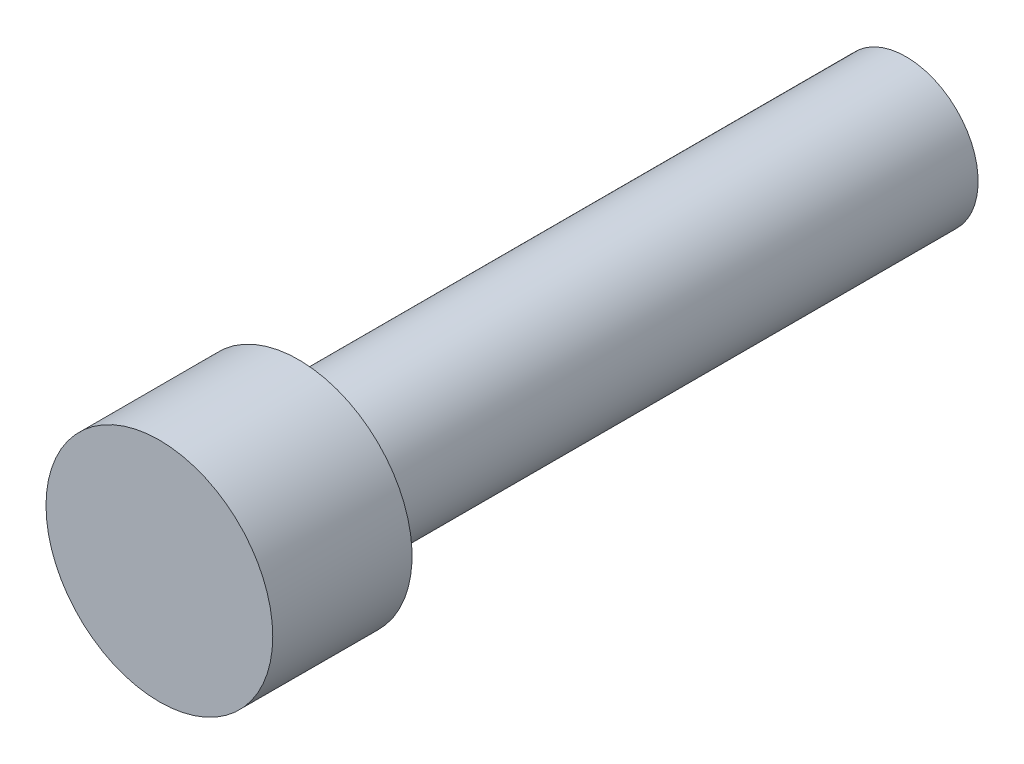
ISO-10303-21;
HEADER;
FILE_DESCRIPTION(('STEP AP214'),'2;1');
FILE_NAME('part.step','',(''),(''),'','','');
FILE_SCHEMA(('AUTOMOTIVE_DESIGN { 1 0 10303 214 1 1 1 1 }'));
ENDSEC;
DATA;
#1=APPLICATION_CONTEXT('core data for automotive mechanical design processes');
#2=APPLICATION_PROTOCOL_DEFINITION('international standard','automotive_design',2000,#1);
#3=PRODUCT_CONTEXT('',#1,'mechanical');
#4=PRODUCT('Part','Part','',(#3));
#5=PRODUCT_RELATED_PRODUCT_CATEGORY('part','',(#4));
#6=PRODUCT_DEFINITION_FORMATION('','',#4);
#7=PRODUCT_DEFINITION_CONTEXT('part definition',#1,'design');
#8=PRODUCT_DEFINITION('design','',#6,#7);
#9=PRODUCT_DEFINITION_SHAPE('','',#8);
#10=(LENGTH_UNIT() NAMED_UNIT(*) SI_UNIT(.MILLI.,.METRE.));
#11=(NAMED_UNIT(*) PLANE_ANGLE_UNIT() SI_UNIT($,.RADIAN.));
#12=(NAMED_UNIT(*) SI_UNIT($,.STERADIAN.) SOLID_ANGLE_UNIT());
#13=UNCERTAINTY_MEASURE_WITH_UNIT(LENGTH_MEASURE(1.E-05),#10,'distance_accuracy_value','');
#14=(GEOMETRIC_REPRESENTATION_CONTEXT(3) GLOBAL_UNCERTAINTY_ASSIGNED_CONTEXT((#13)) GLOBAL_UNIT_ASSIGNED_CONTEXT((#10,
#11,#12)) REPRESENTATION_CONTEXT('',''));
#15=CARTESIAN_POINT('',(0.,0.,0.));
#16=DIRECTION('',(0.,0.,1.));
#17=DIRECTION('',(1.,0.,0.));
#18=AXIS2_PLACEMENT_3D('',#15,#16,#17);
#19=CARTESIAN_POINT('',(0.,0.,11.7094));
#20=DIRECTION('',(0.,0.,-1.));
#21=DIRECTION('',(-1.,0.,0.));
#22=AXIS2_PLACEMENT_3D('',#19,#20,#21);
#23=CYLINDRICAL_SURFACE('',#22,1.778);
#24=CARTESIAN_POINT('',(0.,0.,11.7094));
#25=DIRECTION('',(0.,0.,1.));
#26=DIRECTION('',(1.,0.,0.));
#27=AXIS2_PLACEMENT_3D('',#24,#25,#26);
#28=CIRCLE('',#27,1.778);
#29=CARTESIAN_POINT('',(1.778,0.,11.7094));
#30=VERTEX_POINT('',#29);
#31=EDGE_CURVE('E11',#30,#30,#28,.T.);
#32=ORIENTED_EDGE('',*,*,#31,.F.);
#33=EDGE_LOOP('',(#32));
#34=FACE_BOUND('',#33,.T.);
#35=CARTESIAN_POINT('',(0.,0.,9.525));
#36=DIRECTION('',(0.,0.,-1.));
#37=DIRECTION('',(-1.,0.,0.));
#38=AXIS2_PLACEMENT_3D('',#35,#36,#37);
#39=CIRCLE('',#38,1.778);
#40=CARTESIAN_POINT('',(-1.778,0.,9.525));
#41=VERTEX_POINT('',#40);
#42=EDGE_CURVE('E36',#41,#41,#39,.T.);
#43=ORIENTED_EDGE('',*,*,#42,.F.);
#44=EDGE_LOOP('',(#43));
#45=FACE_BOUND('',#44,.T.);
#46=ADVANCED_FACE('F33',(#34,#45),#23,.T.);
#47=CARTESIAN_POINT('',(0.,0.,11.7094));
#48=DIRECTION('',(0.,0.,1.));
#49=DIRECTION('',(1.,0.,0.));
#50=AXIS2_PLACEMENT_3D('',#47,#48,#49);
#51=PLANE('',#50);
#52=ORIENTED_EDGE('',*,*,#31,.T.);
#53=EDGE_LOOP('',(#52));
#54=FACE_BOUND('',#53,.T.);
#55=ADVANCED_FACE('F57',(#54),#51,.T.);
#56=CARTESIAN_POINT('',(0.,0.,9.525));
#57=DIRECTION('',(0.,0.,-1.));
#58=DIRECTION('',(-1.,0.,0.));
#59=AXIS2_PLACEMENT_3D('',#56,#57,#58);
#60=PLANE('',#59);
#61=CARTESIAN_POINT('',(0.,0.,9.525));
#62=DIRECTION('',(0.,0.,-1.));
#63=DIRECTION('',(-1.,0.,0.));
#64=AXIS2_PLACEMENT_3D('',#61,#62,#63);
#65=CIRCLE('',#64,1.1303);
#66=CARTESIAN_POINT('',(-1.1303,0.,9.525));
#67=VERTEX_POINT('',#66);
#68=EDGE_CURVE('E43',#67,#67,#65,.T.);
#69=ORIENTED_EDGE('',*,*,#68,.F.);
#70=EDGE_LOOP('',(#69));
#71=FACE_BOUND('',#70,.T.);
#72=ORIENTED_EDGE('',*,*,#42,.T.);
#73=EDGE_LOOP('',(#72));
#74=FACE_BOUND('',#73,.T.);
#75=ADVANCED_FACE('F54',(#71,#74),#60,.T.);
#76=CARTESIAN_POINT('',(0.,0.,9.525));
#77=DIRECTION('',(0.,0.,-1.));
#78=DIRECTION('',(-1.,0.,0.));
#79=AXIS2_PLACEMENT_3D('',#76,#77,#78);
#80=CYLINDRICAL_SURFACE('',#79,1.1303);
#81=ORIENTED_EDGE('',*,*,#68,.T.);
#82=EDGE_LOOP('',(#81));
#83=FACE_BOUND('',#82,.T.);
#84=CARTESIAN_POINT('',(0.,0.,0.));
#85=DIRECTION('',(0.,0.,-1.));
#86=DIRECTION('',(-1.,0.,0.));
#87=AXIS2_PLACEMENT_3D('',#84,#85,#86);
#88=CIRCLE('',#87,1.1303);
#89=CARTESIAN_POINT('',(-1.1303,0.,0.));
#90=VERTEX_POINT('',#89);
#91=EDGE_CURVE('E45',#90,#90,#88,.T.);
#92=ORIENTED_EDGE('',*,*,#91,.F.);
#93=EDGE_LOOP('',(#92));
#94=FACE_BOUND('',#93,.T.);
#95=ADVANCED_FACE('F51',(#83,#94),#80,.T.);
#96=CARTESIAN_POINT('',(0.,0.,0.));
#97=DIRECTION('',(0.,0.,1.));
#98=DIRECTION('',(1.,0.,0.));
#99=AXIS2_PLACEMENT_3D('',#96,#97,#98);
#100=PLANE('',#99);
#101=ORIENTED_EDGE('',*,*,#91,.T.);
#102=EDGE_LOOP('',(#101));
#103=FACE_BOUND('',#102,.T.);
#104=ADVANCED_FACE('F70',(#103),#100,.F.);
#105=CLOSED_SHELL('',(#46,#55,#75,#95,#104));
#106=MANIFOLD_SOLID_BREP('B2',#105);
#107=ADVANCED_BREP_SHAPE_REPRESENTATION('',(#18,#106),#14);
#108=SHAPE_DEFINITION_REPRESENTATION(#9,#107);
ENDSEC;
END-ISO-10303-21;
